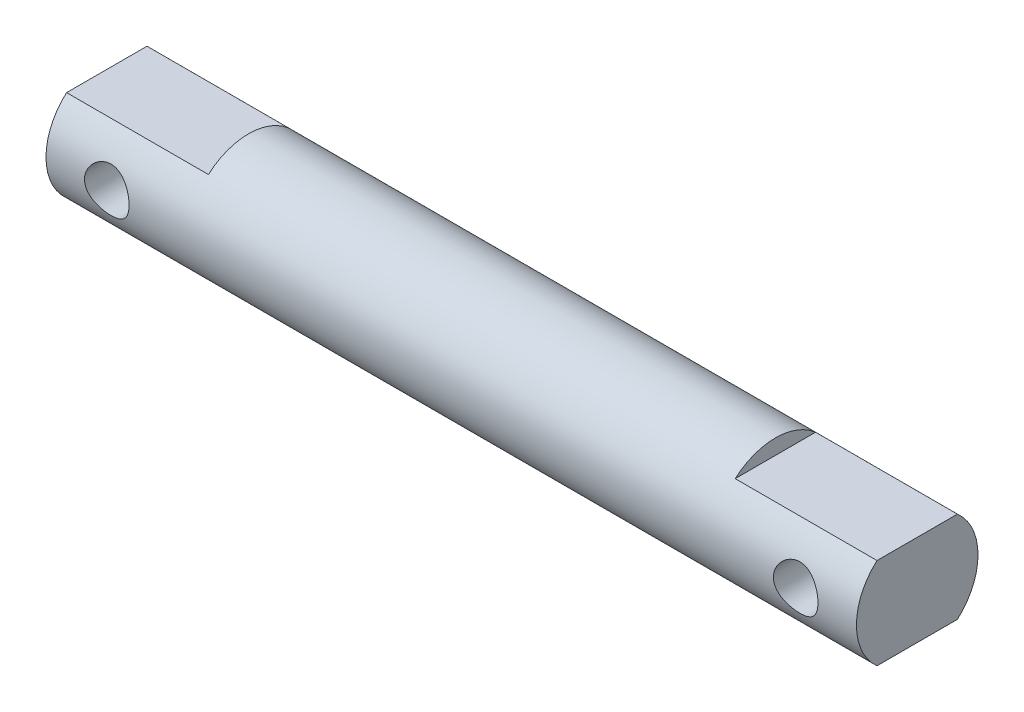
ISO-10303-21;
HEADER;
FILE_DESCRIPTION(('STEP AP214'),'2;1');
FILE_NAME('part.step','',(''),(''),'','','');
FILE_SCHEMA(('AUTOMOTIVE_DESIGN { 1 0 10303 214 1 1 1 1 }'));
ENDSEC;
DATA;
#1=APPLICATION_CONTEXT('core data for automotive mechanical design processes');
#2=APPLICATION_PROTOCOL_DEFINITION('international standard','automotive_design',2000,#1);
#3=PRODUCT_CONTEXT('',#1,'mechanical');
#4=PRODUCT('Part','Part','',(#3));
#5=PRODUCT_RELATED_PRODUCT_CATEGORY('part','',(#4));
#6=PRODUCT_DEFINITION_FORMATION('','',#4);
#7=PRODUCT_DEFINITION_CONTEXT('part definition',#1,'design');
#8=PRODUCT_DEFINITION('design','',#6,#7);
#9=PRODUCT_DEFINITION_SHAPE('','',#8);
#10=(LENGTH_UNIT() NAMED_UNIT(*) SI_UNIT(.MILLI.,.METRE.));
#11=(NAMED_UNIT(*) PLANE_ANGLE_UNIT() SI_UNIT($,.RADIAN.));
#12=(NAMED_UNIT(*) SI_UNIT($,.STERADIAN.) SOLID_ANGLE_UNIT());
#13=UNCERTAINTY_MEASURE_WITH_UNIT(LENGTH_MEASURE(1.E-05),#10,'distance_accuracy_value','');
#14=(GEOMETRIC_REPRESENTATION_CONTEXT(3) GLOBAL_UNCERTAINTY_ASSIGNED_CONTEXT((#13)) GLOBAL_UNIT_ASSIGNED_CONTEXT((#10,
#11,#12)) REPRESENTATION_CONTEXT('',''));
#15=CARTESIAN_POINT('',(0.,0.,0.));
#16=DIRECTION('',(0.,0.,1.));
#17=DIRECTION('',(1.,0.,0.));
#18=AXIS2_PLACEMENT_3D('',#15,#16,#17);
#19=CARTESIAN_POINT('',(-20.,3.,0.));
#20=DIRECTION('',(1.,0.,0.));
#21=DIRECTION('',(0.,0.,-1.));
#22=AXIS2_PLACEMENT_3D('',#19,#20,#21);
#23=PLANE('',#22);
#24=CARTESIAN_POINT('',(-20.,0.,0.));
#25=DIRECTION('',(-1.,0.,0.));
#26=DIRECTION('',(0.,0.,1.));
#27=AXIS2_PLACEMENT_3D('',#24,#25,#26);
#28=CIRCLE('',#27,3.);
#29=CARTESIAN_POINT('',(-20.,2.25,-1.98431348329845));
#30=VERTEX_POINT('',#29);
#31=CARTESIAN_POINT('',(-20.,-2.25,-1.98431348329845));
#32=VERTEX_POINT('',#31);
#33=EDGE_CURVE('E176',#30,#32,#28,.T.);
#34=ORIENTED_EDGE('',*,*,#33,.T.);
#35=DIRECTION('',(0.,0.,1.));
#36=VECTOR('',#35,1.);
#37=CARTESIAN_POINT('',(-20.,-2.25,-3.));
#38=LINE('',#37,#36);
#39=CARTESIAN_POINT('',(-20.,-2.25,1.98431348329845));
#40=VERTEX_POINT('',#39);
#41=EDGE_CURVE('E177',#32,#40,#38,.T.);
#42=ORIENTED_EDGE('',*,*,#41,.T.);
#43=CARTESIAN_POINT('',(-20.,2.25,1.98431348329845));
#44=VERTEX_POINT('',#43);
#45=EDGE_CURVE('E185',#40,#44,#28,.T.);
#46=ORIENTED_EDGE('',*,*,#45,.T.);
#47=DIRECTION('',(0.,0.,1.));
#48=VECTOR('',#47,1.);
#49=CARTESIAN_POINT('',(-20.,2.25,-3.));
#50=LINE('',#49,#48);
#51=EDGE_CURVE('E180',#30,#44,#50,.T.);
#52=ORIENTED_EDGE('',*,*,#51,.F.);
#53=EDGE_LOOP('',(#34,#42,#46,#52));
#54=FACE_BOUND('',#53,.T.);
#55=ADVANCED_FACE('F31',(#54),#23,.F.);
#56=CARTESIAN_POINT('',(20.,3.,0.));
#57=DIRECTION('',(-1.,0.,0.));
#58=DIRECTION('',(0.,0.,1.));
#59=AXIS2_PLACEMENT_3D('',#56,#57,#58);
#60=PLANE('',#59);
#61=CARTESIAN_POINT('',(20.,0.,0.));
#62=DIRECTION('',(-1.,0.,0.));
#63=DIRECTION('',(0.,0.,1.));
#64=AXIS2_PLACEMENT_3D('',#61,#62,#63);
#65=CIRCLE('',#64,3.);
#66=CARTESIAN_POINT('',(20.,-2.25,1.98431348329845));
#67=VERTEX_POINT('',#66);
#68=CARTESIAN_POINT('',(20.,2.25,1.98431348329845));
#69=VERTEX_POINT('',#68);
#70=EDGE_CURVE('E184',#67,#69,#65,.T.);
#71=ORIENTED_EDGE('',*,*,#70,.F.);
#72=DIRECTION('',(0.,0.,1.));
#73=VECTOR('',#72,1.);
#74=CARTESIAN_POINT('',(20.,-2.24999999999999,-3.));
#75=LINE('',#74,#73);
#76=CARTESIAN_POINT('',(20.,-2.24999999999999,-1.98431348329845));
#77=VERTEX_POINT('',#76);
#78=EDGE_CURVE('E49',#77,#67,#75,.T.);
#79=ORIENTED_EDGE('',*,*,#78,.F.);
#80=CARTESIAN_POINT('',(20.,2.25,-1.98431348329845));
#81=VERTEX_POINT('',#80);
#82=EDGE_CURVE('E115',#81,#77,#65,.T.);
#83=ORIENTED_EDGE('',*,*,#82,.F.);
#84=DIRECTION('',(0.,0.,1.));
#85=VECTOR('',#84,1.);
#86=CARTESIAN_POINT('',(20.,2.25,-3.));
#87=LINE('',#86,#85);
#88=EDGE_CURVE('E57',#81,#69,#87,.T.);
#89=ORIENTED_EDGE('',*,*,#88,.T.);
#90=EDGE_LOOP('',(#71,#79,#83,#89));
#91=FACE_BOUND('',#90,.T.);
#92=ADVANCED_FACE('F166',(#91),#60,.F.);
#93=CARTESIAN_POINT('',(0.,0.,0.));
#94=DIRECTION('',(-1.,0.,0.));
#95=DIRECTION('',(0.,0.,1.));
#96=AXIS2_PLACEMENT_3D('',#93,#94,#95);
#97=CYLINDRICAL_SURFACE('',#96,3.);
#98=CARTESIAN_POINT('',(18.1,0.,-3.));
#99=CARTESIAN_POINT('',(18.1000016959377,0.0596653603658475,-3.00000124874777));
#100=CARTESIAN_POINT('',(18.0951301942859,0.119318861047392,-2.99820433362878));
#101=CARTESIAN_POINT('',(18.0758476944229,0.236848244255451,-2.99121508676533));
#102=CARTESIAN_POINT('',(18.0614376008315,0.294724294806991,-2.98602307700504));
#103=CARTESIAN_POINT('',(18.0236525816176,0.40698713855009,-2.97280239953096));
#104=CARTESIAN_POINT('',(18.0002944784406,0.461380257103498,-2.96477905699958));
#105=CARTESIAN_POINT('',(17.9453600789518,0.56547335680578,-2.94669890184719));
#106=CARTESIAN_POINT('',(17.9137816850185,0.615172135653516,-2.93664157034718));
#107=CARTESIAN_POINT('',(17.8419533651427,0.710497168894281,-2.91507648167801));
#108=CARTESIAN_POINT('',(17.8014267972003,0.75590589164363,-2.90352893596448));
#109=CARTESIAN_POINT('',(17.7134398983826,0.839455790057789,-2.88048533673688));
#110=CARTESIAN_POINT('',(17.6659775853424,0.877594880931809,-2.86898929891451));
#111=CARTESIAN_POINT('',(17.563376148578,0.946876023491567,-2.84689276879725));
#112=CARTESIAN_POINT('',(17.5080218172978,0.977715943844815,-2.83633955824423));
#113=CARTESIAN_POINT('',(17.3924637493466,1.02955228614908,-2.81793972857027));
#114=CARTESIAN_POINT('',(17.3322618630331,1.0505524433536,-2.81009208269453));
#115=CARTESIAN_POINT('',(17.2112164474398,1.0812631510737,-2.798415961319));
#116=CARTESIAN_POINT('',(17.1504925023863,1.09138742706648,-2.79444077822037));
#117=CARTESIAN_POINT('',(17.0280875242816,1.10135267987145,-2.7905293041686));
#118=CARTESIAN_POINT('',(16.9664068739079,1.10119766744092,-2.79059143794103));
#119=CARTESIAN_POINT('',(16.8475684309638,1.09092609853663,-2.7946206462547));
#120=CARTESIAN_POINT('',(16.7903527714323,1.08137599754645,-2.79836566494697));
#121=CARTESIAN_POINT('',(16.6784010781988,1.05351920552002,-2.80897082219962));
#122=CARTESIAN_POINT('',(16.6236654025675,1.03521125437041,-2.81583140903281));
#123=CARTESIAN_POINT('',(16.5170456833763,0.990035328733109,-2.8320333504401));
#124=CARTESIAN_POINT('',(16.4652325623985,0.963016175829748,-2.84141799234525));
#125=CARTESIAN_POINT('',(16.3667082597295,0.90129006472429,-2.86159544268106));
#126=CARTESIAN_POINT('',(16.3199987915719,0.866580536276021,-2.87238872140381));
#127=CARTESIAN_POINT('',(16.2298618065168,0.78784062113783,-2.89501075010137));
#128=CARTESIAN_POINT('',(16.1868359200932,0.743355730941567,-2.90686155110834));
#129=CARTESIAN_POINT('',(16.1087384983429,0.647663117597076,-2.92966708861006));
#130=CARTESIAN_POINT('',(16.0736680803958,0.596454451658583,-2.94062169909304));
#131=CARTESIAN_POINT('',(16.0120600315232,0.487779773000808,-2.96060161705553));
#132=CARTESIAN_POINT('',(15.9856506658485,0.430235217521433,-2.96959731294347));
#133=CARTESIAN_POINT('',(15.9430190273705,0.311108672774423,-2.98442731277654));
#134=CARTESIAN_POINT('',(15.9267924370579,0.249528406901531,-2.99026295644358));
#135=CARTESIAN_POINT('',(15.9057463597197,0.127462862761651,-2.99788264484015));
#136=CARTESIAN_POINT('',(15.900385667251,0.0670827891130075,-2.99985872688891));
#137=CARTESIAN_POINT('',(15.8996547992509,-0.0537391869774852,-3.0001264355405));
#138=CARTESIAN_POINT('',(15.9042825233452,-0.114181073749808,-2.99841883675149));
#139=CARTESIAN_POINT('',(15.9229819168092,-0.231108406159618,-2.99163788470485));
#140=CARTESIAN_POINT('',(15.9367037311999,-0.287657784812599,-2.98668929450055));
#141=CARTESIAN_POINT('',(15.9727460210941,-0.397615636671328,-2.97404894323754));
#142=CARTESIAN_POINT('',(15.9950676153823,-0.451023700166589,-2.96635682527047));
#143=CARTESIAN_POINT('',(16.0483784353486,-0.554908427976737,-2.94871738617956));
#144=CARTESIAN_POINT('',(16.0795992520196,-0.605255980194477,-2.93871137811358));
#145=CARTESIAN_POINT('',(16.1495585567129,-0.700162701835578,-2.91755723487566));
#146=CARTESIAN_POINT('',(16.188299730741,-0.744719793590156,-2.90640869230438));
#147=CARTESIAN_POINT('',(16.274729050306,-0.829360890855199,-2.88343377289124));
#148=CARTESIAN_POINT('',(16.322794023905,-0.8690601956203,-2.87160406892303));
#149=CARTESIAN_POINT('',(16.4251419979686,-0.939899669781492,-2.84920568198054));
#150=CARTESIAN_POINT('',(16.4794254299312,-0.971039244708763,-2.83863708661841));
#151=CARTESIAN_POINT('',(16.5930149486137,-1.02386254843665,-2.8200170700311));
#152=CARTESIAN_POINT('',(16.6523338404576,-1.04552125182698,-2.81197232633534));
#153=CARTESIAN_POINT('',(16.7741515392404,-1.0784092993252,-2.79952649364981));
#154=CARTESIAN_POINT('',(16.8366484733941,-1.08964471233036,-2.79512328456104));
#155=CARTESIAN_POINT('',(16.9589005440155,-1.10083806784982,-2.79073255817453));
#156=CARTESIAN_POINT('',(17.0185873167862,-1.1014482886697,-2.79048965654101));
#157=CARTESIAN_POINT('',(17.1371646200869,-1.09303145247646,-2.7937971077441));
#158=CARTESIAN_POINT('',(17.1960552190201,-1.0840052287752,-2.79734713258729));
#159=CARTESIAN_POINT('',(17.3097076343864,-1.05707078841707,-2.80763225279226));
#160=CARTESIAN_POINT('',(17.3645387880301,-1.03941724094369,-2.81427578061567));
#161=CARTESIAN_POINT('',(17.4704956611847,-0.995949426173609,-2.82994981114228));
#162=CARTESIAN_POINT('',(17.5216204604584,-0.970133140652863,-2.83898090407659));
#163=CARTESIAN_POINT('',(17.62153059325,-0.909551414968637,-2.85898260515673));
#164=CARTESIAN_POINT('',(17.6700657713279,-0.874398504847363,-2.87002834990345));
#165=CARTESIAN_POINT('',(17.7607572977932,-0.796752399809455,-2.89254526375225));
#166=CARTESIAN_POINT('',(17.8029116572399,-0.75425692497287,-2.90401656412106));
#167=CARTESIAN_POINT('',(17.8818239918814,-0.660548639786974,-2.92679216754413));
#168=CARTESIAN_POINT('',(17.9181989614741,-0.609002616112062,-2.93805837226635));
#169=CARTESIAN_POINT('',(17.9817509381987,-0.500136860580025,-2.95853467976325));
#170=CARTESIAN_POINT('',(18.00892790779,-0.442817105159342,-2.96774477414609));
#171=CARTESIAN_POINT('',(18.0536679906505,-0.322493606369645,-2.9832468592136));
#172=CARTESIAN_POINT('',(18.0709760902518,-0.259384186418022,-2.9894608548018));
#173=CARTESIAN_POINT('',(18.0941386087502,-0.130844392872352,-2.99783583601898));
#174=CARTESIAN_POINT('',(18.0999981406317,-0.0654150686575989,-2.99999863091548));
#175=CARTESIAN_POINT('',(18.1,0.,-3.));
#176=B_SPLINE_CURVE_WITH_KNOTS('',3,(#98,#99,#100,#101,#102,#103,#104,#105,#106,#107,#108,#109,
#110,#111,#112,#113,#114,#115,#116,#117,#118,#119,#120,#121,#122,#123,#124,#125,#126,#127,#128,
#129,#130,#131,#132,#133,#134,#135,#136,#137,#138,#139,#140,#141,#142,#143,#144,#145,#146,#147,
#148,#149,#150,#151,#152,#153,#154,#155,#156,#157,#158,#159,#160,#161,#162,#163,#164,#165,#166,
#167,#168,#169,#170,#171,#172,#173,#174,#175),.UNSPECIFIED.,.T.,.F.,(4,2,2,2,2,2,2,2,2,2,2,2,2,
2,2,2,2,2,2,2,2,2,2,2,2,2,2,2,2,2,2,2,2,2,2,2,2,2,4),(0.,0.178754907739739,0.357492865169349,
0.535896427659754,0.714345559175,0.899369895863449,1.08444721440599,1.27620269157261,
1.46788531772088,1.65198550181501,1.83601385439912,2.00958682077848,2.18318476902303,
2.35997410918523,2.53682262453215,2.72499447820699,2.91319274508038,3.10406398185192,
3.29485423420864,3.47588192225445,3.65687154732447,3.83127381950643,4.00569878814085,
4.18515848390998,4.36468239466834,4.55415458027959,4.74363992131372,4.93362244947296,
5.12349429191199,5.3016658147168,5.47982193138111,5.65301061537202,5.82624215351945,
6.00825949460879,6.19033345531301,6.38165835431486,6.57298403417707,6.76905241099166,
6.96503320271032),.UNSPECIFIED.);
#177=CARTESIAN_POINT('',(18.1,0.,-3.));
#178=VERTEX_POINT('',#177);
#179=EDGE_CURVE('E11',#178,#178,#176,.T.);
#180=ORIENTED_EDGE('',*,*,#179,.T.);
#181=EDGE_LOOP('',(#180));
#182=FACE_BOUND('',#181,.T.);
#183=CARTESIAN_POINT('',(18.1,0.,3.));
#184=CARTESIAN_POINT('',(18.1000016959377,-0.0596653603658475,3.00000124874777));
#185=CARTESIAN_POINT('',(18.0951301942859,-0.119318861047392,2.99820433362878));
#186=CARTESIAN_POINT('',(18.0758476944229,-0.236848244255451,2.99121508676533));
#187=CARTESIAN_POINT('',(18.0614376008315,-0.294724294806991,2.98602307700504));
#188=CARTESIAN_POINT('',(18.0236525816176,-0.40698713855009,2.97280239953096));
#189=CARTESIAN_POINT('',(18.0002944784406,-0.461380257103498,2.96477905699958));
#190=CARTESIAN_POINT('',(17.9453600789518,-0.56547335680578,2.94669890184719));
#191=CARTESIAN_POINT('',(17.9137816850185,-0.615172135653516,2.93664157034718));
#192=CARTESIAN_POINT('',(17.8419533651427,-0.710497168894281,2.91507648167801));
#193=CARTESIAN_POINT('',(17.8014267972003,-0.75590589164363,2.90352893596448));
#194=CARTESIAN_POINT('',(17.7134398983826,-0.839455790057789,2.88048533673688));
#195=CARTESIAN_POINT('',(17.6659775853424,-0.877594880931809,2.86898929891451));
#196=CARTESIAN_POINT('',(17.563376148578,-0.946876023491567,2.84689276879725));
#197=CARTESIAN_POINT('',(17.5080218172978,-0.977715943844815,2.83633955824423));
#198=CARTESIAN_POINT('',(17.3924637493466,-1.02955228614908,2.81793972857027));
#199=CARTESIAN_POINT('',(17.3322618630331,-1.0505524433536,2.81009208269453));
#200=CARTESIAN_POINT('',(17.2112164474398,-1.0812631510737,2.798415961319));
#201=CARTESIAN_POINT('',(17.1504925023863,-1.09138742706648,2.79444077822037));
#202=CARTESIAN_POINT('',(17.0280875242816,-1.10135267987145,2.7905293041686));
#203=CARTESIAN_POINT('',(16.9664068739079,-1.10119766744092,2.79059143794103));
#204=CARTESIAN_POINT('',(16.8475684309638,-1.09092609853663,2.7946206462547));
#205=CARTESIAN_POINT('',(16.7903527714323,-1.08137599754645,2.79836566494697));
#206=CARTESIAN_POINT('',(16.6784010781988,-1.05351920552002,2.80897082219962));
#207=CARTESIAN_POINT('',(16.6236654025675,-1.03521125437041,2.81583140903281));
#208=CARTESIAN_POINT('',(16.5170456833763,-0.990035328733109,2.8320333504401));
#209=CARTESIAN_POINT('',(16.4652325623985,-0.963016175829748,2.84141799234525));
#210=CARTESIAN_POINT('',(16.3667082597295,-0.90129006472429,2.86159544268106));
#211=CARTESIAN_POINT('',(16.3199987915719,-0.866580536276021,2.87238872140381));
#212=CARTESIAN_POINT('',(16.2298618065168,-0.78784062113783,2.89501075010137));
#213=CARTESIAN_POINT('',(16.1868359200932,-0.743355730941567,2.90686155110834));
#214=CARTESIAN_POINT('',(16.1087384983429,-0.647663117597076,2.92966708861006));
#215=CARTESIAN_POINT('',(16.0736680803958,-0.596454451658583,2.94062169909304));
#216=CARTESIAN_POINT('',(16.0120600315232,-0.487779773000808,2.96060161705553));
#217=CARTESIAN_POINT('',(15.9856506658485,-0.430235217521433,2.96959731294347));
#218=CARTESIAN_POINT('',(15.9430190273705,-0.311108672774423,2.98442731277654));
#219=CARTESIAN_POINT('',(15.9267924370579,-0.249528406901531,2.99026295644358));
#220=CARTESIAN_POINT('',(15.9057463597197,-0.127462862761651,2.99788264484015));
#221=CARTESIAN_POINT('',(15.900385667251,-0.0670827891130075,2.99985872688891));
#222=CARTESIAN_POINT('',(15.8996547992509,0.0537391869774852,3.0001264355405));
#223=CARTESIAN_POINT('',(15.9042825233452,0.114181073749808,2.99841883675149));
#224=CARTESIAN_POINT('',(15.9229819168092,0.231108406159618,2.99163788470485));
#225=CARTESIAN_POINT('',(15.9367037311999,0.287657784812599,2.98668929450055));
#226=CARTESIAN_POINT('',(15.9727460210941,0.397615636671328,2.97404894323754));
#227=CARTESIAN_POINT('',(15.9950676153823,0.451023700166589,2.96635682527047));
#228=CARTESIAN_POINT('',(16.0483784353486,0.554908427976737,2.94871738617956));
#229=CARTESIAN_POINT('',(16.0795992520196,0.605255980194477,2.93871137811358));
#230=CARTESIAN_POINT('',(16.1495585567129,0.700162701835578,2.91755723487566));
#231=CARTESIAN_POINT('',(16.188299730741,0.744719793590156,2.90640869230438));
#232=CARTESIAN_POINT('',(16.274729050306,0.829360890855199,2.88343377289124));
#233=CARTESIAN_POINT('',(16.322794023905,0.8690601956203,2.87160406892303));
#234=CARTESIAN_POINT('',(16.4251419979686,0.939899669781492,2.84920568198054));
#235=CARTESIAN_POINT('',(16.4794254299312,0.971039244708763,2.83863708661841));
#236=CARTESIAN_POINT('',(16.5930149486137,1.02386254843665,2.8200170700311));
#237=CARTESIAN_POINT('',(16.6523338404576,1.04552125182698,2.81197232633534));
#238=CARTESIAN_POINT('',(16.7741515392404,1.0784092993252,2.79952649364981));
#239=CARTESIAN_POINT('',(16.8366484733941,1.08964471233036,2.79512328456104));
#240=CARTESIAN_POINT('',(16.9589005440155,1.10083806784982,2.79073255817453));
#241=CARTESIAN_POINT('',(17.0185873167862,1.1014482886697,2.79048965654101));
#242=CARTESIAN_POINT('',(17.1371646200869,1.09303145247646,2.7937971077441));
#243=CARTESIAN_POINT('',(17.1960552190201,1.0840052287752,2.79734713258729));
#244=CARTESIAN_POINT('',(17.3097076343864,1.05707078841707,2.80763225279226));
#245=CARTESIAN_POINT('',(17.3645387880301,1.03941724094369,2.81427578061567));
#246=CARTESIAN_POINT('',(17.4704956611847,0.995949426173609,2.82994981114228));
#247=CARTESIAN_POINT('',(17.5216204604584,0.970133140652863,2.83898090407659));
#248=CARTESIAN_POINT('',(17.62153059325,0.909551414968637,2.85898260515673));
#249=CARTESIAN_POINT('',(17.6700657713279,0.874398504847363,2.87002834990345));
#250=CARTESIAN_POINT('',(17.7607572977932,0.796752399809455,2.89254526375225));
#251=CARTESIAN_POINT('',(17.8029116572399,0.75425692497287,2.90401656412106));
#252=CARTESIAN_POINT('',(17.8818239918814,0.660548639786974,2.92679216754413));
#253=CARTESIAN_POINT('',(17.9181989614741,0.609002616112062,2.93805837226635));
#254=CARTESIAN_POINT('',(17.9817509381987,0.500136860580025,2.95853467976325));
#255=CARTESIAN_POINT('',(18.00892790779,0.442817105159342,2.96774477414609));
#256=CARTESIAN_POINT('',(18.0536679906505,0.322493606369645,2.9832468592136));
#257=CARTESIAN_POINT('',(18.0709760902518,0.259384186418022,2.9894608548018));
#258=CARTESIAN_POINT('',(18.0941386087502,0.130844392872352,2.99783583601898));
#259=CARTESIAN_POINT('',(18.0999981406317,0.0654150686575989,2.99999863091548));
#260=CARTESIAN_POINT('',(18.1,0.,3.));
#261=B_SPLINE_CURVE_WITH_KNOTS('',3,(#183,#184,#185,#186,#187,#188,#189,#190,#191,#192,#193,
#194,#195,#196,#197,#198,#199,#200,#201,#202,#203,#204,#205,#206,#207,#208,#209,#210,#211,#212,
#213,#214,#215,#216,#217,#218,#219,#220,#221,#222,#223,#224,#225,#226,#227,#228,#229,#230,#231,
#232,#233,#234,#235,#236,#237,#238,#239,#240,#241,#242,#243,#244,#245,#246,#247,#248,#249,#250,
#251,#252,#253,#254,#255,#256,#257,#258,#259,#260),.UNSPECIFIED.,.T.,.F.,(4,2,2,2,2,2,2,2,2,2,2,
2,2,2,2,2,2,2,2,2,2,2,2,2,2,2,2,2,2,2,2,2,2,2,2,2,2,2,4),(0.,0.178754907739739,
0.357492865169349,0.535896427659754,0.714345559175,0.899369895863449,1.08444721440599,
1.27620269157261,1.46788531772088,1.65198550181501,1.83601385439912,2.00958682077848,
2.18318476902303,2.35997410918523,2.53682262453215,2.72499447820699,2.91319274508038,
3.10406398185192,3.29485423420864,3.47588192225445,3.65687154732447,3.83127381950643,
4.00569878814085,4.18515848390998,4.36468239466834,4.55415458027959,4.74363992131372,
4.93362244947296,5.12349429191199,5.3016658147168,5.47982193138111,5.65301061537202,
5.82624215351945,6.00825949460879,6.19033345531301,6.38165835431486,6.57298403417707,
6.76905241099166,6.96503320271032),.UNSPECIFIED.);
#262=CARTESIAN_POINT('',(18.1,0.,3.));
#263=VERTEX_POINT('',#262);
#264=EDGE_CURVE('E42',#263,#263,#261,.T.);
#265=ORIENTED_EDGE('',*,*,#264,.T.);
#266=EDGE_LOOP('',(#265));
#267=FACE_BOUND('',#266,.T.);
#268=CARTESIAN_POINT('',(-15.9,0.,-3.));
#269=CARTESIAN_POINT('',(-15.8999983040623,0.0596653603658482,-3.00000124874777));
#270=CARTESIAN_POINT('',(-15.9048698057141,0.119318861047393,-2.99820433362878));
#271=CARTESIAN_POINT('',(-15.9241523055771,0.236848244255452,-2.99121508676533));
#272=CARTESIAN_POINT('',(-15.9385623991685,0.294724294806991,-2.98602307700504));
#273=CARTESIAN_POINT('',(-15.9763474183824,0.406987138550091,-2.97280239953095));
#274=CARTESIAN_POINT('',(-15.9997055215594,0.461380257103499,-2.96477905699958));
#275=CARTESIAN_POINT('',(-16.0546399210482,0.565473356805781,-2.94669890184719));
#276=CARTESIAN_POINT('',(-16.0862183149815,0.615172135653517,-2.93664157034718));
#277=CARTESIAN_POINT('',(-16.1580466348573,0.710497168894281,-2.91507648167801));
#278=CARTESIAN_POINT('',(-16.1985732027997,0.755905891643631,-2.90352893596448));
#279=CARTESIAN_POINT('',(-16.2865601016174,0.839455790057789,-2.88048533673688));
#280=CARTESIAN_POINT('',(-16.3340224146576,0.877594880931809,-2.86898929891451));
#281=CARTESIAN_POINT('',(-16.436623851422,0.946876023491567,-2.84689276879725));
#282=CARTESIAN_POINT('',(-16.4919781827022,0.977715943844814,-2.83633955824423));
#283=CARTESIAN_POINT('',(-16.6075362506534,1.02955228614908,-2.81793972857028));
#284=CARTESIAN_POINT('',(-16.6677381369669,1.0505524433536,-2.81009208269453));
#285=CARTESIAN_POINT('',(-16.7887835525602,1.0812631510737,-2.798415961319));
#286=CARTESIAN_POINT('',(-16.8495074976137,1.09138742706649,-2.79444077822037));
#287=CARTESIAN_POINT('',(-16.9719124757184,1.10135267987145,-2.7905293041686));
#288=CARTESIAN_POINT('',(-17.0335931260921,1.10119766744092,-2.79059143794103));
#289=CARTESIAN_POINT('',(-17.1524315690362,1.09092609853663,-2.7946206462547));
#290=CARTESIAN_POINT('',(-17.2096472285677,1.08137599754645,-2.79836566494697));
#291=CARTESIAN_POINT('',(-17.3215989218012,1.05351920552002,-2.80897082219962));
#292=CARTESIAN_POINT('',(-17.3763345974325,1.03521125437041,-2.81583140903281));
#293=CARTESIAN_POINT('',(-17.4829543166237,0.99003532873311,-2.8320333504401));
#294=CARTESIAN_POINT('',(-17.5347674376015,0.963016175829748,-2.84141799234525));
#295=CARTESIAN_POINT('',(-17.6332917402705,0.90129006472429,-2.86159544268106));
#296=CARTESIAN_POINT('',(-17.6800012084281,0.866580536276022,-2.87238872140381));
#297=CARTESIAN_POINT('',(-17.7701381934832,0.787840621137831,-2.89501075010137));
#298=CARTESIAN_POINT('',(-17.8131640799068,0.743355730941568,-2.90686155110834));
#299=CARTESIAN_POINT('',(-17.8912615016571,0.647663117597076,-2.92966708861006));
#300=CARTESIAN_POINT('',(-17.9263319196042,0.596454451658584,-2.94062169909304));
#301=CARTESIAN_POINT('',(-17.9879399684768,0.487779773000809,-2.96060161705553));
#302=CARTESIAN_POINT('',(-18.0143493341515,0.430235217521433,-2.96959731294347));
#303=CARTESIAN_POINT('',(-18.0569809726295,0.311108672774424,-2.98442731277654));
#304=CARTESIAN_POINT('',(-18.0732075629421,0.249528406901532,-2.99026295644358));
#305=CARTESIAN_POINT('',(-18.0942536402803,0.127462862761652,-2.99788264484015));
#306=CARTESIAN_POINT('',(-18.099614332749,0.0670827891130084,-2.99985872688891));
#307=CARTESIAN_POINT('',(-18.1003452007491,-0.0537391869774844,-3.0001264355405));
#308=CARTESIAN_POINT('',(-18.0957174766548,-0.114181073749808,-2.99841883675149));
#309=CARTESIAN_POINT('',(-18.0770180831908,-0.231108406159617,-2.99163788470485));
#310=CARTESIAN_POINT('',(-18.0632962688001,-0.287657784812598,-2.98668929450055));
#311=CARTESIAN_POINT('',(-18.0272539789059,-0.397615636671328,-2.97404894323754));
#312=CARTESIAN_POINT('',(-18.0049323846177,-0.451023700166588,-2.96635682527047));
#313=CARTESIAN_POINT('',(-17.9516215646514,-0.554908427976736,-2.94871738617956));
#314=CARTESIAN_POINT('',(-17.9204007479804,-0.605255980194476,-2.93871137811358));
#315=CARTESIAN_POINT('',(-17.8504414432871,-0.700162701835577,-2.91755723487566));
#316=CARTESIAN_POINT('',(-17.811700269259,-0.744719793590155,-2.90640869230438));
#317=CARTESIAN_POINT('',(-17.725270949694,-0.829360890855198,-2.88343377289124));
#318=CARTESIAN_POINT('',(-17.677205976095,-0.869060195620299,-2.87160406892303));
#319=CARTESIAN_POINT('',(-17.5748580020314,-0.939899669781491,-2.84920568198054));
#320=CARTESIAN_POINT('',(-17.5205745700688,-0.971039244708762,-2.83863708661841));
#321=CARTESIAN_POINT('',(-17.4069850513863,-1.02386254843664,-2.8200170700311));
#322=CARTESIAN_POINT('',(-17.3476661595424,-1.04552125182697,-2.81197232633534));
#323=CARTESIAN_POINT('',(-17.2258484607596,-1.07840929932519,-2.79952649364981));
#324=CARTESIAN_POINT('',(-17.1633515266059,-1.08964471233036,-2.79512328456104));
#325=CARTESIAN_POINT('',(-17.0410994559845,-1.10083806784982,-2.79073255817453));
#326=CARTESIAN_POINT('',(-16.9814126832138,-1.1014482886697,-2.79048965654101));
#327=CARTESIAN_POINT('',(-16.8628353799131,-1.09303145247646,-2.7937971077441));
#328=CARTESIAN_POINT('',(-16.8039447809799,-1.0840052287752,-2.79734713258729));
#329=CARTESIAN_POINT('',(-16.6902923656136,-1.05707078841707,-2.80763225279226));
#330=CARTESIAN_POINT('',(-16.6354612119699,-1.03941724094368,-2.81427578061567));
#331=CARTESIAN_POINT('',(-16.5295043388153,-0.995949426173609,-2.82994981114228));
#332=CARTESIAN_POINT('',(-16.4783795395416,-0.970133140652862,-2.83898090407659));
#333=CARTESIAN_POINT('',(-16.37846940675,-0.909551414968637,-2.85898260515673));
#334=CARTESIAN_POINT('',(-16.3299342286721,-0.874398504847364,-2.87002834990345));
#335=CARTESIAN_POINT('',(-16.2392427022068,-0.796752399809457,-2.89254526375225));
#336=CARTESIAN_POINT('',(-16.1970883427601,-0.754256924972871,-2.90401656412106));
#337=CARTESIAN_POINT('',(-16.1181760081186,-0.660548639786974,-2.92679216754413));
#338=CARTESIAN_POINT('',(-16.0818010385259,-0.609002616112062,-2.93805837226635));
#339=CARTESIAN_POINT('',(-16.0182490618013,-0.500136860580024,-2.95853467976325));
#340=CARTESIAN_POINT('',(-15.99107209221,-0.442817105159341,-2.96774477414609));
#341=CARTESIAN_POINT('',(-15.9463320093495,-0.322493606369644,-2.9832468592136));
#342=CARTESIAN_POINT('',(-15.9290239097482,-0.259384186418021,-2.9894608548018));
#343=CARTESIAN_POINT('',(-15.9058613912498,-0.130844392872351,-2.99783583601898));
#344=CARTESIAN_POINT('',(-15.9000018593683,-0.0654150686575983,-2.99999863091548));
#345=CARTESIAN_POINT('',(-15.9,0.,-3.));
#346=B_SPLINE_CURVE_WITH_KNOTS('',3,(#268,#269,#270,#271,#272,#273,#274,#275,#276,#277,#278,
#279,#280,#281,#282,#283,#284,#285,#286,#287,#288,#289,#290,#291,#292,#293,#294,#295,#296,#297,
#298,#299,#300,#301,#302,#303,#304,#305,#306,#307,#308,#309,#310,#311,#312,#313,#314,#315,#316,
#317,#318,#319,#320,#321,#322,#323,#324,#325,#326,#327,#328,#329,#330,#331,#332,#333,#334,#335,
#336,#337,#338,#339,#340,#341,#342,#343,#344,#345),.UNSPECIFIED.,.T.,.F.,(4,2,2,2,2,2,2,2,2,2,2,
2,2,2,2,2,2,2,2,2,2,2,2,2,2,2,2,2,2,2,2,2,2,2,2,2,2,2,4),(0.,0.178754907739739,
0.357492865169349,0.535896427659754,0.714345559175,0.899369895863449,1.08444721440599,
1.2762026915726,1.46788531772088,1.65198550181501,1.83601385439912,2.00958682077848,
2.18318476902303,2.35997410918523,2.53682262453215,2.72499447820699,2.91319274508038,
3.10406398185192,3.29485423420864,3.47588192225445,3.65687154732447,3.83127381950643,
4.00569878814085,4.18515848390998,4.36468239466834,4.55415458027959,4.74363992131372,
4.93362244947295,5.12349429191199,5.3016658147168,5.4798219313811,5.65301061537201,
5.82624215351945,6.00825949460879,6.190333455313,6.38165835431486,6.57298403417707,
6.76905241099166,6.96503320271032),.UNSPECIFIED.);
#347=CARTESIAN_POINT('',(-15.9,0.,-3.));
#348=VERTEX_POINT('',#347);
#349=EDGE_CURVE('E119',#348,#348,#346,.T.);
#350=ORIENTED_EDGE('',*,*,#349,.T.);
#351=EDGE_LOOP('',(#350));
#352=FACE_BOUND('',#351,.T.);
#353=CARTESIAN_POINT('',(-15.9,0.,3.));
#354=CARTESIAN_POINT('',(-15.8999983040623,-0.0596653603658475,3.00000124874777));
#355=CARTESIAN_POINT('',(-15.9048698057141,-0.119318861047392,2.99820433362878));
#356=CARTESIAN_POINT('',(-15.9241523055771,-0.236848244255451,2.99121508676533));
#357=CARTESIAN_POINT('',(-15.9385623991685,-0.294724294806991,2.98602307700504));
#358=CARTESIAN_POINT('',(-15.9763474183824,-0.40698713855009,2.97280239953096));
#359=CARTESIAN_POINT('',(-15.9997055215594,-0.461380257103498,2.96477905699958));
#360=CARTESIAN_POINT('',(-16.0546399210482,-0.565473356805779,2.94669890184719));
#361=CARTESIAN_POINT('',(-16.0862183149815,-0.615172135653516,2.93664157034718));
#362=CARTESIAN_POINT('',(-16.1580466348573,-0.710497168894281,2.91507648167801));
#363=CARTESIAN_POINT('',(-16.1985732027997,-0.75590589164363,2.90352893596448));
#364=CARTESIAN_POINT('',(-16.2865601016174,-0.839455790057788,2.88048533673688));
#365=CARTESIAN_POINT('',(-16.3340224146576,-0.877594880931808,2.86898929891451));
#366=CARTESIAN_POINT('',(-16.436623851422,-0.946876023491566,2.84689276879725));
#367=CARTESIAN_POINT('',(-16.4919781827022,-0.977715943844813,2.83633955824423));
#368=CARTESIAN_POINT('',(-16.6075362506534,-1.02955228614908,2.81793972857028));
#369=CARTESIAN_POINT('',(-16.6677381369669,-1.0505524433536,2.81009208269453));
#370=CARTESIAN_POINT('',(-16.7887835525602,-1.0812631510737,2.798415961319));
#371=CARTESIAN_POINT('',(-16.8495074976137,-1.09138742706648,2.79444077822038));
#372=CARTESIAN_POINT('',(-16.9719124757184,-1.10135267987145,2.7905293041686));
#373=CARTESIAN_POINT('',(-17.0335931260921,-1.10119766744092,2.79059143794103));
#374=CARTESIAN_POINT('',(-17.1524315690362,-1.09092609853663,2.7946206462547));
#375=CARTESIAN_POINT('',(-17.2096472285677,-1.08137599754645,2.79836566494697));
#376=CARTESIAN_POINT('',(-17.3215989218012,-1.05351920552002,2.80897082219962));
#377=CARTESIAN_POINT('',(-17.3763345974325,-1.03521125437041,2.81583140903281));
#378=CARTESIAN_POINT('',(-17.4829543166237,-0.990035328733108,2.8320333504401));
#379=CARTESIAN_POINT('',(-17.5347674376015,-0.963016175829747,2.84141799234525));
#380=CARTESIAN_POINT('',(-17.6332917402705,-0.901290064724289,2.86159544268106));
#381=CARTESIAN_POINT('',(-17.6800012084281,-0.86658053627602,2.87238872140381));
#382=CARTESIAN_POINT('',(-17.7701381934832,-0.78784062113783,2.89501075010137));
#383=CARTESIAN_POINT('',(-17.8131640799068,-0.743355730941567,2.90686155110834));
#384=CARTESIAN_POINT('',(-17.8912615016571,-0.647663117597075,2.92966708861006));
#385=CARTESIAN_POINT('',(-17.9263319196042,-0.596454451658582,2.94062169909304));
#386=CARTESIAN_POINT('',(-17.9879399684768,-0.487779773000807,2.96060161705553));
#387=CARTESIAN_POINT('',(-18.0143493341515,-0.430235217521431,2.96959731294347));
#388=CARTESIAN_POINT('',(-18.0569809726295,-0.311108672774422,2.98442731277654));
#389=CARTESIAN_POINT('',(-18.0732075629421,-0.24952840690153,2.99026295644358));
#390=CARTESIAN_POINT('',(-18.0942536402803,-0.12746286276165,2.99788264484015));
#391=CARTESIAN_POINT('',(-18.099614332749,-0.0670827891130068,2.99985872688891));
#392=CARTESIAN_POINT('',(-18.1003452007491,0.0537391869774859,3.0001264355405));
#393=CARTESIAN_POINT('',(-18.0957174766548,0.114181073749809,2.99841883675149));
#394=CARTESIAN_POINT('',(-18.0770180831908,0.231108406159619,2.99163788470485));
#395=CARTESIAN_POINT('',(-18.0632962688001,0.2876577848126,2.98668929450055));
#396=CARTESIAN_POINT('',(-18.0272539789059,0.397615636671329,2.97404894323754));
#397=CARTESIAN_POINT('',(-18.0049323846177,0.45102370016659,2.96635682527047));
#398=CARTESIAN_POINT('',(-17.9516215646514,0.554908427976738,2.94871738617956));
#399=CARTESIAN_POINT('',(-17.9204007479804,0.605255980194477,2.93871137811357));
#400=CARTESIAN_POINT('',(-17.8504414432871,0.700162701835579,2.91755723487566));
#401=CARTESIAN_POINT('',(-17.811700269259,0.744719793590157,2.90640869230438));
#402=CARTESIAN_POINT('',(-17.725270949694,0.829360890855199,2.88343377289124));
#403=CARTESIAN_POINT('',(-17.677205976095,0.8690601956203,2.87160406892303));
#404=CARTESIAN_POINT('',(-17.5748580020314,0.939899669781493,2.84920568198054));
#405=CARTESIAN_POINT('',(-17.5205745700688,0.971039244708763,2.83863708661841));
#406=CARTESIAN_POINT('',(-17.4069850513863,1.02386254843665,2.8200170700311));
#407=CARTESIAN_POINT('',(-17.3476661595424,1.04552125182698,2.81197232633534));
#408=CARTESIAN_POINT('',(-17.2258484607596,1.0784092993252,2.79952649364981));
#409=CARTESIAN_POINT('',(-17.1633515266059,1.08964471233036,2.79512328456104));
#410=CARTESIAN_POINT('',(-17.0410994559845,1.10083806784982,2.79073255817453));
#411=CARTESIAN_POINT('',(-16.9814126832138,1.1014482886697,2.79048965654101));
#412=CARTESIAN_POINT('',(-16.8628353799131,1.09303145247646,2.7937971077441));
#413=CARTESIAN_POINT('',(-16.8039447809799,1.0840052287752,2.79734713258729));
#414=CARTESIAN_POINT('',(-16.6902923656136,1.05707078841707,2.80763225279226));
#415=CARTESIAN_POINT('',(-16.6354612119699,1.03941724094369,2.81427578061567));
#416=CARTESIAN_POINT('',(-16.5295043388153,0.99594942617361,2.82994981114228));
#417=CARTESIAN_POINT('',(-16.4783795395416,0.970133140652864,2.83898090407659));
#418=CARTESIAN_POINT('',(-16.37846940675,0.909551414968638,2.85898260515673));
#419=CARTESIAN_POINT('',(-16.3299342286721,0.874398504847364,2.87002834990345));
#420=CARTESIAN_POINT('',(-16.2392427022068,0.796752399809456,2.89254526375225));
#421=CARTESIAN_POINT('',(-16.1970883427601,0.75425692497287,2.90401656412106));
#422=CARTESIAN_POINT('',(-16.1181760081186,0.660548639786973,2.92679216754413));
#423=CARTESIAN_POINT('',(-16.0818010385259,0.60900261611206,2.93805837226635));
#424=CARTESIAN_POINT('',(-16.0182490618013,0.500136860580023,2.95853467976325));
#425=CARTESIAN_POINT('',(-15.99107209221,0.442817105159341,2.96774477414609));
#426=CARTESIAN_POINT('',(-15.9463320093495,0.322493606369645,2.9832468592136));
#427=CARTESIAN_POINT('',(-15.9290239097482,0.259384186418022,2.9894608548018));
#428=CARTESIAN_POINT('',(-15.9058613912498,0.130844392872351,2.99783583601898));
#429=CARTESIAN_POINT('',(-15.9000018593683,0.0654150686575987,2.99999863091548));
#430=CARTESIAN_POINT('',(-15.9,0.,3.));
#431=B_SPLINE_CURVE_WITH_KNOTS('',3,(#353,#354,#355,#356,#357,#358,#359,#360,#361,#362,#363,
#364,#365,#366,#367,#368,#369,#370,#371,#372,#373,#374,#375,#376,#377,#378,#379,#380,#381,#382,
#383,#384,#385,#386,#387,#388,#389,#390,#391,#392,#393,#394,#395,#396,#397,#398,#399,#400,#401,
#402,#403,#404,#405,#406,#407,#408,#409,#410,#411,#412,#413,#414,#415,#416,#417,#418,#419,#420,
#421,#422,#423,#424,#425,#426,#427,#428,#429,#430),.UNSPECIFIED.,.T.,.F.,(4,2,2,2,2,2,2,2,2,2,2,
2,2,2,2,2,2,2,2,2,2,2,2,2,2,2,2,2,2,2,2,2,2,2,2,2,2,2,4),(0.,0.178754907739739,
0.357492865169349,0.535896427659755,0.714345559174999,0.899369895863448,1.08444721440599,
1.2762026915726,1.46788531772088,1.65198550181501,1.83601385439912,2.00958682077848,
2.18318476902303,2.35997410918523,2.53682262453215,2.72499447820699,2.91319274508038,
3.10406398185192,3.29485423420864,3.47588192225445,3.65687154732446,3.83127381950643,
4.00569878814084,4.18515848390998,4.36468239466833,4.55415458027959,4.74363992131372,
4.93362244947295,5.12349429191199,5.3016658147168,5.4798219313811,5.65301061537201,
5.82624215351945,6.00825949460879,6.190333455313,6.38165835431486,6.57298403417707,
6.76905241099166,6.96503320271032),.UNSPECIFIED.);
#432=CARTESIAN_POINT('',(-15.9,0.,3.));
#433=VERTEX_POINT('',#432);
#434=EDGE_CURVE('E116',#433,#433,#431,.T.);
#435=ORIENTED_EDGE('',*,*,#434,.T.);
#436=EDGE_LOOP('',(#435));
#437=FACE_BOUND('',#436,.T.);
#438=ORIENTED_EDGE('',*,*,#45,.F.);
#439=DIRECTION('',(-1.,0.,0.));
#440=VECTOR('',#439,1.);
#441=CARTESIAN_POINT('',(0.,-2.25,1.98431348329845));
#442=LINE('',#441,#440);
#443=CARTESIAN_POINT('',(-13.,-2.25,1.98431348329844));
#444=VERTEX_POINT('',#443);
#445=EDGE_CURVE('E204',#40,#444,#442,.F.);
#446=ORIENTED_EDGE('',*,*,#445,.T.);
#447=CARTESIAN_POINT('',(-13.,0.,0.));
#448=DIRECTION('',(1.,0.,0.));
#449=DIRECTION('',(0.,0.,-1.));
#450=AXIS2_PLACEMENT_3D('',#447,#448,#449);
#451=CIRCLE('',#450,3.);
#452=CARTESIAN_POINT('',(-13.,-2.25,-1.98431348329844));
#453=VERTEX_POINT('',#452);
#454=EDGE_CURVE('E199',#444,#453,#451,.T.);
#455=ORIENTED_EDGE('',*,*,#454,.T.);
#456=DIRECTION('',(-1.,0.,0.));
#457=VECTOR('',#456,1.);
#458=CARTESIAN_POINT('',(0.,-2.25,-1.98431348329845));
#459=LINE('',#458,#457);
#460=EDGE_CURVE('E202',#453,#32,#459,.T.);
#461=ORIENTED_EDGE('',*,*,#460,.T.);
#462=ORIENTED_EDGE('',*,*,#33,.F.);
#463=DIRECTION('',(-1.,0.,0.));
#464=VECTOR('',#463,1.);
#465=CARTESIAN_POINT('',(0.,2.25,-1.98431348329845));
#466=LINE('',#465,#464);
#467=CARTESIAN_POINT('',(-13.,2.25,-1.98431348329845));
#468=VERTEX_POINT('',#467);
#469=EDGE_CURVE('E192',#30,#468,#466,.F.);
#470=ORIENTED_EDGE('',*,*,#469,.T.);
#471=CARTESIAN_POINT('',(-13.,0.,0.));
#472=DIRECTION('',(1.,0.,0.));
#473=DIRECTION('',(0.,0.,-1.));
#474=AXIS2_PLACEMENT_3D('',#471,#472,#473);
#475=CIRCLE('',#474,3.);
#476=CARTESIAN_POINT('',(-13.,2.25,1.98431348329845));
#477=VERTEX_POINT('',#476);
#478=EDGE_CURVE('E194',#468,#477,#475,.T.);
#479=ORIENTED_EDGE('',*,*,#478,.T.);
#480=DIRECTION('',(-1.,0.,0.));
#481=VECTOR('',#480,1.);
#482=CARTESIAN_POINT('',(0.,2.25,1.98431348329845));
#483=LINE('',#482,#481);
#484=EDGE_CURVE('E196',#477,#44,#483,.T.);
#485=ORIENTED_EDGE('',*,*,#484,.T.);
#486=EDGE_LOOP('',(#438,#446,#455,#461,#462,#470,#479,#485));
#487=FACE_BOUND('',#486,.T.);
#488=DIRECTION('',(-1.,0.,0.));
#489=VECTOR('',#488,1.);
#490=CARTESIAN_POINT('',(0.,-2.25,-1.98431348329845));
#491=LINE('',#490,#489);
#492=CARTESIAN_POINT('',(13.,-2.24999999999999,-1.98431348329845));
#493=VERTEX_POINT('',#492);
#494=EDGE_CURVE('E106',#77,#493,#491,.T.);
#495=ORIENTED_EDGE('',*,*,#494,.T.);
#496=CARTESIAN_POINT('',(13.,0.,0.));
#497=DIRECTION('',(-1.,0.,0.));
#498=DIRECTION('',(0.,-1.,0.));
#499=AXIS2_PLACEMENT_3D('',#496,#497,#498);
#500=CIRCLE('',#499,3.);
#501=CARTESIAN_POINT('',(13.,-2.24999999999999,1.98431348329845));
#502=VERTEX_POINT('',#501);
#503=EDGE_CURVE('E100',#493,#502,#500,.T.);
#504=ORIENTED_EDGE('',*,*,#503,.T.);
#505=DIRECTION('',(-1.,0.,0.));
#506=VECTOR('',#505,1.);
#507=CARTESIAN_POINT('',(0.,-2.25,1.98431348329845));
#508=LINE('',#507,#506);
#509=EDGE_CURVE('E107',#502,#67,#508,.F.);
#510=ORIENTED_EDGE('',*,*,#509,.T.);
#511=ORIENTED_EDGE('',*,*,#70,.T.);
#512=DIRECTION('',(-1.,0.,0.));
#513=VECTOR('',#512,1.);
#514=CARTESIAN_POINT('',(0.,2.25,1.98431348329845));
#515=LINE('',#514,#513);
#516=CARTESIAN_POINT('',(13.,2.25,1.98431348329845));
#517=VERTEX_POINT('',#516);
#518=EDGE_CURVE('E212',#69,#517,#515,.T.);
#519=ORIENTED_EDGE('',*,*,#518,.T.);
#520=CARTESIAN_POINT('',(13.,0.,0.));
#521=DIRECTION('',(-1.,0.,0.));
#522=DIRECTION('',(0.,0.,1.));
#523=AXIS2_PLACEMENT_3D('',#520,#521,#522);
#524=CIRCLE('',#523,3.);
#525=CARTESIAN_POINT('',(13.,2.25,-1.98431348329845));
#526=VERTEX_POINT('',#525);
#527=EDGE_CURVE('E209',#517,#526,#524,.T.);
#528=ORIENTED_EDGE('',*,*,#527,.T.);
#529=DIRECTION('',(-1.,0.,0.));
#530=VECTOR('',#529,1.);
#531=CARTESIAN_POINT('',(0.,2.25,-1.98431348329845));
#532=LINE('',#531,#530);
#533=EDGE_CURVE('E207',#526,#81,#532,.F.);
#534=ORIENTED_EDGE('',*,*,#533,.T.);
#535=ORIENTED_EDGE('',*,*,#82,.T.);
#536=EDGE_LOOP('',(#495,#504,#510,#511,#519,#528,#534,#535));
#537=FACE_BOUND('',#536,.T.);
#538=ADVANCED_FACE('F113',(#182,#267,#352,#437,#487,#537),#97,.T.);
#539=CARTESIAN_POINT('',(-13.,3.,-3.));
#540=DIRECTION('',(1.,0.,0.));
#541=DIRECTION('',(0.,0.,-1.));
#542=AXIS2_PLACEMENT_3D('',#539,#540,#541);
#543=PLANE('',#542);
#544=DIRECTION('',(0.,0.,1.));
#545=VECTOR('',#544,1.);
#546=CARTESIAN_POINT('',(-13.,2.25,-3.));
#547=LINE('',#546,#545);
#548=EDGE_CURVE('E188',#468,#477,#547,.T.);
#549=ORIENTED_EDGE('',*,*,#548,.T.);
#550=ORIENTED_EDGE('',*,*,#478,.F.);
#551=EDGE_LOOP('',(#549,#550));
#552=FACE_BOUND('',#551,.T.);
#553=ADVANCED_FACE('F158',(#552),#543,.F.);
#554=CARTESIAN_POINT('',(-20.,2.25,-3.));
#555=DIRECTION('',(0.,-1.,0.));
#556=DIRECTION('',(0.,0.,-1.));
#557=AXIS2_PLACEMENT_3D('',#554,#555,#556);
#558=PLANE('',#557);
#559=ORIENTED_EDGE('',*,*,#548,.F.);
#560=ORIENTED_EDGE('',*,*,#469,.F.);
#561=ORIENTED_EDGE('',*,*,#51,.T.);
#562=ORIENTED_EDGE('',*,*,#484,.F.);
#563=EDGE_LOOP('',(#559,#560,#561,#562));
#564=FACE_BOUND('',#563,.T.);
#565=ADVANCED_FACE('F153',(#564),#558,.F.);
#566=CARTESIAN_POINT('',(-20.,-2.25,-3.));
#567=DIRECTION('',(0.,1.,0.));
#568=DIRECTION('',(-1.,0.,0.));
#569=AXIS2_PLACEMENT_3D('',#566,#567,#568);
#570=PLANE('',#569);
#571=DIRECTION('',(0.,0.,1.));
#572=VECTOR('',#571,1.);
#573=CARTESIAN_POINT('',(-13.,-2.25,-3.));
#574=LINE('',#573,#572);
#575=EDGE_CURVE('E215',#453,#444,#574,.T.);
#576=ORIENTED_EDGE('',*,*,#575,.T.);
#577=ORIENTED_EDGE('',*,*,#445,.F.);
#578=ORIENTED_EDGE('',*,*,#41,.F.);
#579=ORIENTED_EDGE('',*,*,#460,.F.);
#580=EDGE_LOOP('',(#576,#577,#578,#579));
#581=FACE_BOUND('',#580,.T.);
#582=ADVANCED_FACE('F150',(#581),#570,.F.);
#583=CARTESIAN_POINT('',(-13.,-2.25,-3.));
#584=DIRECTION('',(1.,0.,0.));
#585=DIRECTION('',(0.,0.,-1.));
#586=AXIS2_PLACEMENT_3D('',#583,#584,#585);
#587=PLANE('',#586);
#588=ORIENTED_EDGE('',*,*,#575,.F.);
#589=ORIENTED_EDGE('',*,*,#454,.F.);
#590=EDGE_LOOP('',(#588,#589));
#591=FACE_BOUND('',#590,.T.);
#592=ADVANCED_FACE('F148',(#591),#587,.F.);
#593=CARTESIAN_POINT('',(13.,3.,-3.));
#594=DIRECTION('',(-1.,0.,0.));
#595=DIRECTION('',(0.,0.,1.));
#596=AXIS2_PLACEMENT_3D('',#593,#594,#595);
#597=PLANE('',#596);
#598=DIRECTION('',(0.,0.,1.));
#599=VECTOR('',#598,1.);
#600=CARTESIAN_POINT('',(13.,2.25,-3.));
#601=LINE('',#600,#599);
#602=EDGE_CURVE('E110',#526,#517,#601,.T.);
#603=ORIENTED_EDGE('',*,*,#602,.F.);
#604=ORIENTED_EDGE('',*,*,#527,.F.);
#605=EDGE_LOOP('',(#603,#604));
#606=FACE_BOUND('',#605,.T.);
#607=ADVANCED_FACE('F145',(#606),#597,.F.);
#608=CARTESIAN_POINT('',(13.,2.25,-3.));
#609=DIRECTION('',(0.,-1.,0.));
#610=DIRECTION('',(0.,0.,-1.));
#611=AXIS2_PLACEMENT_3D('',#608,#609,#610);
#612=PLANE('',#611);
#613=ORIENTED_EDGE('',*,*,#88,.F.);
#614=ORIENTED_EDGE('',*,*,#533,.F.);
#615=ORIENTED_EDGE('',*,*,#602,.T.);
#616=ORIENTED_EDGE('',*,*,#518,.F.);
#617=EDGE_LOOP('',(#613,#614,#615,#616));
#618=FACE_BOUND('',#617,.T.);
#619=ADVANCED_FACE('F140',(#618),#612,.F.);
#620=CARTESIAN_POINT('',(13.,-2.24999999999999,-3.));
#621=DIRECTION('',(-1.,0.,0.));
#622=DIRECTION('',(0.,-1.,0.));
#623=AXIS2_PLACEMENT_3D('',#620,#621,#622);
#624=PLANE('',#623);
#625=ORIENTED_EDGE('',*,*,#503,.F.);
#626=DIRECTION('',(0.,0.,1.));
#627=VECTOR('',#626,1.);
#628=CARTESIAN_POINT('',(13.,-2.24999999999999,-3.));
#629=LINE('',#628,#627);
#630=EDGE_CURVE('E103',#493,#502,#629,.T.);
#631=ORIENTED_EDGE('',*,*,#630,.T.);
#632=EDGE_LOOP('',(#625,#631));
#633=FACE_BOUND('',#632,.T.);
#634=ADVANCED_FACE('F102',(#633),#624,.F.);
#635=CARTESIAN_POINT('',(20.,-2.24999999999999,-3.));
#636=DIRECTION('',(0.,1.,0.));
#637=DIRECTION('',(-1.,0.,0.));
#638=AXIS2_PLACEMENT_3D('',#635,#636,#637);
#639=PLANE('',#638);
#640=ORIENTED_EDGE('',*,*,#78,.T.);
#641=ORIENTED_EDGE('',*,*,#509,.F.);
#642=ORIENTED_EDGE('',*,*,#630,.F.);
#643=ORIENTED_EDGE('',*,*,#494,.F.);
#644=EDGE_LOOP('',(#640,#641,#642,#643));
#645=FACE_BOUND('',#644,.T.);
#646=ADVANCED_FACE('F109',(#645),#639,.F.);
#647=CARTESIAN_POINT('',(-17.,0.,-3.));
#648=DIRECTION('',(0.,0.,1.));
#649=DIRECTION('',(1.,0.,0.));
#650=AXIS2_PLACEMENT_3D('',#647,#648,#649);
#651=CYLINDRICAL_SURFACE('',#650,1.1);
#652=ORIENTED_EDGE('',*,*,#349,.F.);
#653=EDGE_LOOP('',(#652));
#654=FACE_BOUND('',#653,.T.);
#655=ORIENTED_EDGE('',*,*,#434,.F.);
#656=EDGE_LOOP('',(#655));
#657=FACE_BOUND('',#656,.T.);
#658=ADVANCED_FACE('F130',(#654,#657),#651,.F.);
#659=CARTESIAN_POINT('',(17.,0.,-3.));
#660=DIRECTION('',(0.,0.,1.));
#661=DIRECTION('',(1.,0.,0.));
#662=AXIS2_PLACEMENT_3D('',#659,#660,#661);
#663=CYLINDRICAL_SURFACE('',#662,1.1);
#664=ORIENTED_EDGE('',*,*,#179,.F.);
#665=EDGE_LOOP('',(#664));
#666=FACE_BOUND('',#665,.T.);
#667=ORIENTED_EDGE('',*,*,#264,.F.);
#668=EDGE_LOOP('',(#667));
#669=FACE_BOUND('',#668,.T.);
#670=ADVANCED_FACE('F134',(#666,#669),#663,.F.);
#671=CLOSED_SHELL('',(#55,#92,#538,#553,#565,#582,#592,#607,#619,#634,#646,#658,#670));
#672=MANIFOLD_SOLID_BREP('B2',#671);
#673=ADVANCED_BREP_SHAPE_REPRESENTATION('',(#18,#672),#14);
#674=SHAPE_DEFINITION_REPRESENTATION(#9,#673);
ENDSEC;
END-ISO-10303-21;
